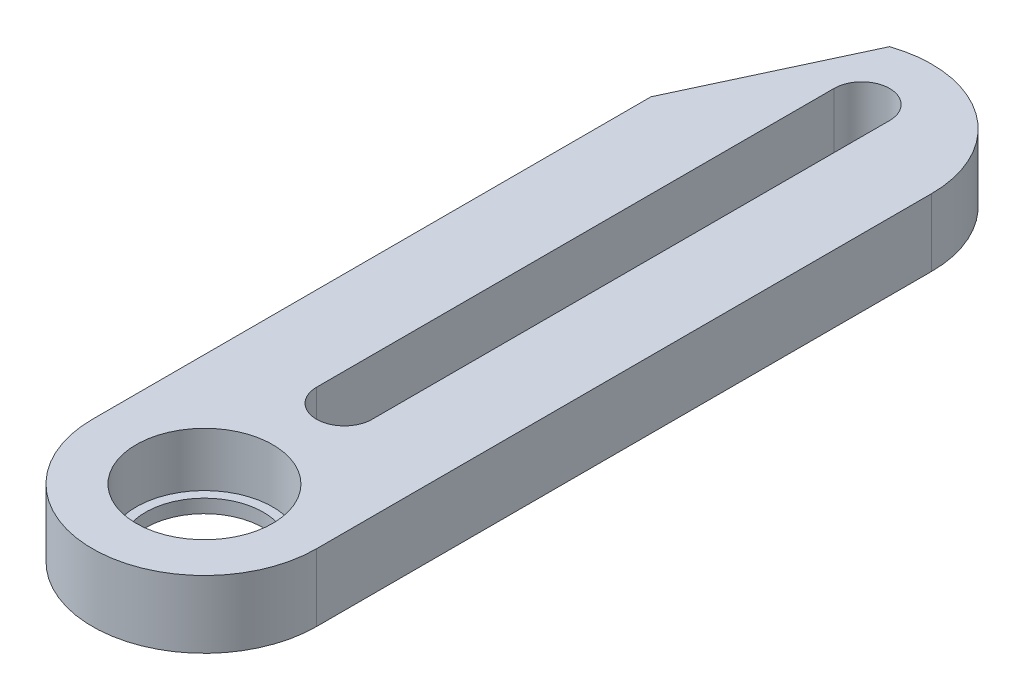
ISO-10303-21;
HEADER;
FILE_DESCRIPTION(('STEP AP214'),'2;1');
FILE_NAME('part.step','',(''),(''),'','','');
FILE_SCHEMA(('AUTOMOTIVE_DESIGN { 1 0 10303 214 1 1 1 1 }'));
ENDSEC;
DATA;
#1=APPLICATION_CONTEXT('core data for automotive mechanical design processes');
#2=APPLICATION_PROTOCOL_DEFINITION('international standard','automotive_design',2000,#1);
#3=PRODUCT_CONTEXT('',#1,'mechanical');
#4=PRODUCT('Part','Part','',(#3));
#5=PRODUCT_RELATED_PRODUCT_CATEGORY('part','',(#4));
#6=PRODUCT_DEFINITION_FORMATION('','',#4);
#7=PRODUCT_DEFINITION_CONTEXT('part definition',#1,'design');
#8=PRODUCT_DEFINITION('design','',#6,#7);
#9=PRODUCT_DEFINITION_SHAPE('','',#8);
#10=(LENGTH_UNIT() NAMED_UNIT(*) SI_UNIT(.MILLI.,.METRE.));
#11=(NAMED_UNIT(*) PLANE_ANGLE_UNIT() SI_UNIT($,.RADIAN.));
#12=(NAMED_UNIT(*) SI_UNIT($,.STERADIAN.) SOLID_ANGLE_UNIT());
#13=UNCERTAINTY_MEASURE_WITH_UNIT(LENGTH_MEASURE(1.E-05),#10,'distance_accuracy_value','');
#14=(GEOMETRIC_REPRESENTATION_CONTEXT(3) GLOBAL_UNCERTAINTY_ASSIGNED_CONTEXT((#13)) GLOBAL_UNIT_ASSIGNED_CONTEXT((#10,
#11,#12)) REPRESENTATION_CONTEXT('',''));
#15=CARTESIAN_POINT('',(0.,0.,0.));
#16=DIRECTION('',(0.,0.,1.));
#17=DIRECTION('',(1.,0.,0.));
#18=AXIS2_PLACEMENT_3D('',#15,#16,#17);
#19=CARTESIAN_POINT('',(0.,4.,0.));
#20=DIRECTION('',(0.,-1.,0.));
#21=DIRECTION('',(0.,0.,-1.));
#22=AXIS2_PLACEMENT_3D('',#19,#20,#21);
#23=CYLINDRICAL_SURFACE('',#22,6.65);
#24=CARTESIAN_POINT('',(0.,0.,0.));
#25=DIRECTION('',(0.,1.,0.));
#26=DIRECTION('',(0.,0.,1.));
#27=AXIS2_PLACEMENT_3D('',#24,#25,#26);
#28=CIRCLE('',#27,6.65);
#29=CARTESIAN_POINT('',(-6.65,0.,0.));
#30=VERTEX_POINT('',#29);
#31=CARTESIAN_POINT('',(6.65,0.,0.));
#32=VERTEX_POINT('',#31);
#33=EDGE_CURVE('E126',#30,#32,#28,.T.);
#34=ORIENTED_EDGE('',*,*,#33,.T.);
#35=DIRECTION('',(0.,-1.,0.));
#36=VECTOR('',#35,1.);
#37=CARTESIAN_POINT('',(6.65,4.,0.));
#38=LINE('',#37,#36);
#39=CARTESIAN_POINT('',(6.65,4.,0.));
#40=VERTEX_POINT('',#39);
#41=EDGE_CURVE('E46',#40,#32,#38,.T.);
#42=ORIENTED_EDGE('',*,*,#41,.F.);
#43=CARTESIAN_POINT('',(0.,4.,0.));
#44=DIRECTION('',(0.,1.,0.));
#45=DIRECTION('',(0.,0.,1.));
#46=AXIS2_PLACEMENT_3D('',#43,#44,#45);
#47=CIRCLE('',#46,6.65);
#48=CARTESIAN_POINT('',(-6.65,4.,0.));
#49=VERTEX_POINT('',#48);
#50=EDGE_CURVE('E115',#49,#40,#47,.T.);
#51=ORIENTED_EDGE('',*,*,#50,.F.);
#52=DIRECTION('',(0.,-1.,0.));
#53=VECTOR('',#52,1.);
#54=CARTESIAN_POINT('',(-6.65,4.,0.));
#55=LINE('',#54,#53);
#56=EDGE_CURVE('E62',#49,#30,#55,.T.);
#57=ORIENTED_EDGE('',*,*,#56,.T.);
#58=EDGE_LOOP('',(#34,#42,#51,#57));
#59=FACE_BOUND('',#58,.T.);
#60=ADVANCED_FACE('F38',(#59),#23,.T.);
#61=CARTESIAN_POINT('',(6.65,4.,0.));
#62=DIRECTION('',(1.,0.,0.));
#63=DIRECTION('',(0.,0.,-1.));
#64=AXIS2_PLACEMENT_3D('',#61,#62,#63);
#65=PLANE('',#64);
#66=DIRECTION('',(0.,0.,1.));
#67=VECTOR('',#66,1.);
#68=CARTESIAN_POINT('',(6.65,0.,0.));
#69=LINE('',#68,#67);
#70=CARTESIAN_POINT('',(6.65,0.,-36.5));
#71=VERTEX_POINT('',#70);
#72=EDGE_CURVE('E159',#71,#32,#69,.T.);
#73=ORIENTED_EDGE('',*,*,#72,.F.);
#74=DIRECTION('',(0.,-1.,0.));
#75=VECTOR('',#74,1.);
#76=CARTESIAN_POINT('',(6.65,4.,-36.5));
#77=LINE('',#76,#75);
#78=CARTESIAN_POINT('',(6.65,4.,-36.5));
#79=VERTEX_POINT('',#78);
#80=EDGE_CURVE('E130',#79,#71,#77,.T.);
#81=ORIENTED_EDGE('',*,*,#80,.F.);
#82=DIRECTION('',(0.,0.,1.));
#83=VECTOR('',#82,1.);
#84=CARTESIAN_POINT('',(6.65,4.,0.));
#85=LINE('',#84,#83);
#86=EDGE_CURVE('E122',#79,#40,#85,.T.);
#87=ORIENTED_EDGE('',*,*,#86,.T.);
#88=ORIENTED_EDGE('',*,*,#41,.T.);
#89=EDGE_LOOP('',(#73,#81,#87,#88));
#90=FACE_BOUND('',#89,.T.);
#91=ADVANCED_FACE('F133',(#90),#65,.T.);
#92=CARTESIAN_POINT('',(0.,4.,-36.5));
#93=DIRECTION('',(0.,-1.,0.));
#94=DIRECTION('',(0.,0.,-1.));
#95=AXIS2_PLACEMENT_3D('',#92,#93,#94);
#96=CYLINDRICAL_SURFACE('',#95,6.65);
#97=DIRECTION('',(0.,-1.,0.));
#98=VECTOR('',#97,1.);
#99=CARTESIAN_POINT('',(-2.15,4.,-42.7928530890209));
#100=LINE('',#99,#98);
#101=CARTESIAN_POINT('',(-2.15,4.,-42.7928530890209));
#102=VERTEX_POINT('',#101);
#103=CARTESIAN_POINT('',(-2.15,0.,-42.7928530890209));
#104=VERTEX_POINT('',#103);
#105=EDGE_CURVE('E53',#102,#104,#100,.T.);
#106=ORIENTED_EDGE('',*,*,#105,.F.);
#107=CARTESIAN_POINT('',(0.,4.,-36.5));
#108=DIRECTION('',(0.,1.,0.));
#109=DIRECTION('',(0.,0.,1.));
#110=AXIS2_PLACEMENT_3D('',#107,#108,#109);
#111=CIRCLE('',#110,6.65);
#112=EDGE_CURVE('E135',#102,#79,#111,.F.);
#113=ORIENTED_EDGE('',*,*,#112,.T.);
#114=ORIENTED_EDGE('',*,*,#80,.T.);
#115=CARTESIAN_POINT('',(0.,0.,-36.5));
#116=DIRECTION('',(0.,1.,0.));
#117=DIRECTION('',(0.,0.,1.));
#118=AXIS2_PLACEMENT_3D('',#115,#116,#117);
#119=CIRCLE('',#118,6.65);
#120=EDGE_CURVE('E161',#104,#71,#119,.F.);
#121=ORIENTED_EDGE('',*,*,#120,.F.);
#122=EDGE_LOOP('',(#106,#113,#114,#121));
#123=FACE_BOUND('',#122,.T.);
#124=ADVANCED_FACE('F215',(#123),#96,.T.);
#125=CARTESIAN_POINT('',(0.,4.,-8.3));
#126=DIRECTION('',(0.,-1.,0.));
#127=DIRECTION('',(0.,0.,-1.));
#128=AXIS2_PLACEMENT_3D('',#125,#126,#127);
#129=CYLINDRICAL_SURFACE('',#128,1.65);
#130=CARTESIAN_POINT('',(0.,0.,-8.3));
#131=DIRECTION('',(0.,1.,0.));
#132=DIRECTION('',(0.,0.,1.));
#133=AXIS2_PLACEMENT_3D('',#130,#131,#132);
#134=CIRCLE('',#133,1.65);
#135=CARTESIAN_POINT('',(-1.65,0.,-8.3));
#136=VERTEX_POINT('',#135);
#137=CARTESIAN_POINT('',(1.65,0.,-8.3));
#138=VERTEX_POINT('',#137);
#139=EDGE_CURVE('E145',#136,#138,#134,.T.);
#140=ORIENTED_EDGE('',*,*,#139,.F.);
#141=DIRECTION('',(0.,-1.,0.));
#142=VECTOR('',#141,1.);
#143=CARTESIAN_POINT('',(-1.65,4.,-8.3));
#144=LINE('',#143,#142);
#145=CARTESIAN_POINT('',(-1.65,4.,-8.3));
#146=VERTEX_POINT('',#145);
#147=EDGE_CURVE('E98',#146,#136,#144,.T.);
#148=ORIENTED_EDGE('',*,*,#147,.F.);
#149=CARTESIAN_POINT('',(0.,4.,-8.3));
#150=DIRECTION('',(0.,1.,0.));
#151=DIRECTION('',(0.,0.,1.));
#152=AXIS2_PLACEMENT_3D('',#149,#150,#151);
#153=CIRCLE('',#152,1.65);
#154=CARTESIAN_POINT('',(1.65,4.,-8.3));
#155=VERTEX_POINT('',#154);
#156=EDGE_CURVE('E166',#146,#155,#153,.T.);
#157=ORIENTED_EDGE('',*,*,#156,.T.);
#158=DIRECTION('',(0.,-1.,0.));
#159=VECTOR('',#158,1.);
#160=CARTESIAN_POINT('',(1.65,4.,-8.3));
#161=LINE('',#160,#159);
#162=EDGE_CURVE('E144',#155,#138,#161,.T.);
#163=ORIENTED_EDGE('',*,*,#162,.T.);
#164=EDGE_LOOP('',(#140,#148,#157,#163));
#165=FACE_BOUND('',#164,.T.);
#166=ADVANCED_FACE('F40',(#165),#129,.F.);
#167=CARTESIAN_POINT('',(-1.65,4.,0.));
#168=DIRECTION('',(1.,0.,0.));
#169=DIRECTION('',(0.,0.,-1.));
#170=AXIS2_PLACEMENT_3D('',#167,#168,#169);
#171=PLANE('',#170);
#172=DIRECTION('',(0.,0.,1.));
#173=VECTOR('',#172,1.);
#174=CARTESIAN_POINT('',(-1.65,0.,0.));
#175=LINE('',#174,#173);
#176=CARTESIAN_POINT('',(-1.65,0.,-39.));
#177=VERTEX_POINT('',#176);
#178=EDGE_CURVE('E148',#177,#136,#175,.T.);
#179=ORIENTED_EDGE('',*,*,#178,.F.);
#180=DIRECTION('',(0.,-1.,0.));
#181=VECTOR('',#180,1.);
#182=CARTESIAN_POINT('',(-1.65,4.,-39.));
#183=LINE('',#182,#181);
#184=CARTESIAN_POINT('',(-1.65,4.,-39.));
#185=VERTEX_POINT('',#184);
#186=EDGE_CURVE('E172',#185,#177,#183,.T.);
#187=ORIENTED_EDGE('',*,*,#186,.F.);
#188=DIRECTION('',(0.,0.,1.));
#189=VECTOR('',#188,1.);
#190=CARTESIAN_POINT('',(-1.65,4.,0.));
#191=LINE('',#190,#189);
#192=EDGE_CURVE('E178',#185,#146,#191,.T.);
#193=ORIENTED_EDGE('',*,*,#192,.T.);
#194=ORIENTED_EDGE('',*,*,#147,.T.);
#195=EDGE_LOOP('',(#179,#187,#193,#194));
#196=FACE_BOUND('',#195,.T.);
#197=ADVANCED_FACE('F176',(#196),#171,.T.);
#198=CARTESIAN_POINT('',(0.,4.,-39.));
#199=DIRECTION('',(0.,-1.,0.));
#200=DIRECTION('',(0.,0.,-1.));
#201=AXIS2_PLACEMENT_3D('',#198,#199,#200);
#202=CYLINDRICAL_SURFACE('',#201,1.65);
#203=CARTESIAN_POINT('',(0.,0.,-39.));
#204=DIRECTION('',(0.,1.,0.));
#205=DIRECTION('',(0.,0.,1.));
#206=AXIS2_PLACEMENT_3D('',#203,#204,#205);
#207=CIRCLE('',#206,1.65);
#208=CARTESIAN_POINT('',(1.65,0.,-39.));
#209=VERTEX_POINT('',#208);
#210=EDGE_CURVE('E152',#209,#177,#207,.T.);
#211=ORIENTED_EDGE('',*,*,#210,.F.);
#212=DIRECTION('',(0.,-1.,0.));
#213=VECTOR('',#212,1.);
#214=CARTESIAN_POINT('',(1.65,4.,-39.));
#215=LINE('',#214,#213);
#216=CARTESIAN_POINT('',(1.65,4.,-39.));
#217=VERTEX_POINT('',#216);
#218=EDGE_CURVE('E170',#217,#209,#215,.T.);
#219=ORIENTED_EDGE('',*,*,#218,.F.);
#220=CARTESIAN_POINT('',(0.,4.,-39.));
#221=DIRECTION('',(0.,1.,0.));
#222=DIRECTION('',(0.,0.,1.));
#223=AXIS2_PLACEMENT_3D('',#220,#221,#222);
#224=CIRCLE('',#223,1.65);
#225=EDGE_CURVE('E190',#217,#185,#224,.T.);
#226=ORIENTED_EDGE('',*,*,#225,.T.);
#227=ORIENTED_EDGE('',*,*,#186,.T.);
#228=EDGE_LOOP('',(#211,#219,#226,#227));
#229=FACE_BOUND('',#228,.T.);
#230=ADVANCED_FACE('F186',(#229),#202,.F.);
#231=CARTESIAN_POINT('',(-6.65,4.,0.));
#232=DIRECTION('',(-1.,0.,0.));
#233=DIRECTION('',(0.,0.,1.));
#234=AXIS2_PLACEMENT_3D('',#231,#232,#233);
#235=PLANE('',#234);
#236=DIRECTION('',(0.,-1.,0.));
#237=VECTOR('',#236,1.);
#238=CARTESIAN_POINT('',(-6.65,4.,-33.1425719467278));
#239=LINE('',#238,#237);
#240=CARTESIAN_POINT('',(-6.65,4.,-33.1425719467278));
#241=VERTEX_POINT('',#240);
#242=CARTESIAN_POINT('',(-6.65,0.,-33.1425719467278));
#243=VERTEX_POINT('',#242);
#244=EDGE_CURVE('E241',#241,#243,#239,.T.);
#245=ORIENTED_EDGE('',*,*,#244,.T.);
#246=DIRECTION('',(0.,0.,-1.));
#247=VECTOR('',#246,1.);
#248=CARTESIAN_POINT('',(-6.65,0.,0.));
#249=LINE('',#248,#247);
#250=EDGE_CURVE('E163',#30,#243,#249,.T.);
#251=ORIENTED_EDGE('',*,*,#250,.F.);
#252=ORIENTED_EDGE('',*,*,#56,.F.);
#253=DIRECTION('',(0.,0.,-1.));
#254=VECTOR('',#253,1.);
#255=CARTESIAN_POINT('',(-6.65,4.,0.));
#256=LINE('',#255,#254);
#257=EDGE_CURVE('E123',#49,#241,#256,.T.);
#258=ORIENTED_EDGE('',*,*,#257,.T.);
#259=EDGE_LOOP('',(#245,#251,#252,#258));
#260=FACE_BOUND('',#259,.T.);
#261=ADVANCED_FACE('F200',(#260),#235,.T.);
#262=CARTESIAN_POINT('',(1.65,4.,0.));
#263=DIRECTION('',(1.,0.,0.));
#264=DIRECTION('',(0.,0.,-1.));
#265=AXIS2_PLACEMENT_3D('',#262,#263,#264);
#266=PLANE('',#265);
#267=DIRECTION('',(0.,0.,1.));
#268=VECTOR('',#267,1.);
#269=CARTESIAN_POINT('',(1.65,0.,0.));
#270=LINE('',#269,#268);
#271=EDGE_CURVE('E155',#209,#138,#270,.T.);
#272=ORIENTED_EDGE('',*,*,#271,.T.);
#273=ORIENTED_EDGE('',*,*,#162,.F.);
#274=DIRECTION('',(0.,0.,1.));
#275=VECTOR('',#274,1.);
#276=CARTESIAN_POINT('',(1.65,4.,0.));
#277=LINE('',#276,#275);
#278=EDGE_CURVE('E124',#217,#155,#277,.T.);
#279=ORIENTED_EDGE('',*,*,#278,.F.);
#280=ORIENTED_EDGE('',*,*,#218,.T.);
#281=EDGE_LOOP('',(#272,#273,#279,#280));
#282=FACE_BOUND('',#281,.T.);
#283=ADVANCED_FACE('F197',(#282),#266,.F.);
#284=CARTESIAN_POINT('',(0.,4.,0.));
#285=DIRECTION('',(0.,-1.,0.));
#286=DIRECTION('',(0.,0.,-1.));
#287=AXIS2_PLACEMENT_3D('',#284,#285,#286);
#288=CYLINDRICAL_SURFACE('',#287,4.05);
#289=CARTESIAN_POINT('',(0.,0.8,0.));
#290=DIRECTION('',(0.,1.,0.));
#291=DIRECTION('',(0.,0.,1.));
#292=AXIS2_PLACEMENT_3D('',#289,#290,#291);
#293=CIRCLE('',#292,4.05);
#294=CARTESIAN_POINT('',(0.,0.8,4.05));
#295=VERTEX_POINT('',#294);
#296=EDGE_CURVE('E11',#295,#295,#293,.T.);
#297=ORIENTED_EDGE('',*,*,#296,.F.);
#298=EDGE_LOOP('',(#297));
#299=FACE_BOUND('',#298,.T.);
#300=CARTESIAN_POINT('',(0.,4.,0.));
#301=DIRECTION('',(0.,1.,0.));
#302=DIRECTION('',(0.,0.,1.));
#303=AXIS2_PLACEMENT_3D('',#300,#301,#302);
#304=CIRCLE('',#303,4.05);
#305=CARTESIAN_POINT('',(0.,4.,4.05));
#306=VERTEX_POINT('',#305);
#307=EDGE_CURVE('E141',#306,#306,#304,.T.);
#308=ORIENTED_EDGE('',*,*,#307,.T.);
#309=EDGE_LOOP('',(#308));
#310=FACE_BOUND('',#309,.T.);
#311=ADVANCED_FACE('F199',(#299,#310),#288,.F.);
#312=CARTESIAN_POINT('',(0.,4.,0.));
#313=DIRECTION('',(0.,1.,0.));
#314=DIRECTION('',(0.,0.,1.));
#315=AXIS2_PLACEMENT_3D('',#312,#313,#314);
#316=PLANE('',#315);
#317=DIRECTION('',(-0.422618261740694,0.,0.906307787036652));
#318=VECTOR('',#317,1.);
#319=CARTESIAN_POINT('',(-6.65,4.,-33.1425719467278));
#320=LINE('',#319,#318);
#321=EDGE_CURVE('E244',#102,#241,#320,.T.);
#322=ORIENTED_EDGE('',*,*,#321,.T.);
#323=ORIENTED_EDGE('',*,*,#257,.F.);
#324=ORIENTED_EDGE('',*,*,#50,.T.);
#325=ORIENTED_EDGE('',*,*,#86,.F.);
#326=ORIENTED_EDGE('',*,*,#112,.F.);
#327=EDGE_LOOP('',(#322,#323,#324,#325,#326));
#328=FACE_BOUND('',#327,.T.);
#329=ORIENTED_EDGE('',*,*,#156,.F.);
#330=ORIENTED_EDGE('',*,*,#192,.F.);
#331=ORIENTED_EDGE('',*,*,#225,.F.);
#332=ORIENTED_EDGE('',*,*,#278,.T.);
#333=EDGE_LOOP('',(#329,#330,#331,#332));
#334=FACE_BOUND('',#333,.T.);
#335=ORIENTED_EDGE('',*,*,#307,.F.);
#336=EDGE_LOOP('',(#335));
#337=FACE_BOUND('',#336,.T.);
#338=ADVANCED_FACE('F118',(#328,#334,#337),#316,.T.);
#339=CARTESIAN_POINT('',(0.,0.,0.));
#340=DIRECTION('',(0.,1.,0.));
#341=DIRECTION('',(0.,0.,1.));
#342=AXIS2_PLACEMENT_3D('',#339,#340,#341);
#343=PLANE('',#342);
#344=CARTESIAN_POINT('',(0.,0.,0.));
#345=DIRECTION('',(0.,1.,0.));
#346=DIRECTION('',(0.,0.,1.));
#347=AXIS2_PLACEMENT_3D('',#344,#345,#346);
#348=CIRCLE('',#347,3.5);
#349=CARTESIAN_POINT('',(0.,0.,3.5));
#350=VERTEX_POINT('',#349);
#351=EDGE_CURVE('E149',#350,#350,#348,.T.);
#352=ORIENTED_EDGE('',*,*,#351,.T.);
#353=EDGE_LOOP('',(#352));
#354=FACE_BOUND('',#353,.T.);
#355=ORIENTED_EDGE('',*,*,#139,.T.);
#356=ORIENTED_EDGE('',*,*,#271,.F.);
#357=ORIENTED_EDGE('',*,*,#210,.T.);
#358=ORIENTED_EDGE('',*,*,#178,.T.);
#359=EDGE_LOOP('',(#355,#356,#357,#358));
#360=FACE_BOUND('',#359,.T.);
#361=ORIENTED_EDGE('',*,*,#250,.T.);
#362=DIRECTION('',(-0.422618261740694,0.,0.906307787036652));
#363=VECTOR('',#362,1.);
#364=CARTESIAN_POINT('',(-6.65,0.,-33.1425719467278));
#365=LINE('',#364,#363);
#366=EDGE_CURVE('E239',#104,#243,#365,.T.);
#367=ORIENTED_EDGE('',*,*,#366,.F.);
#368=ORIENTED_EDGE('',*,*,#120,.T.);
#369=ORIENTED_EDGE('',*,*,#72,.T.);
#370=ORIENTED_EDGE('',*,*,#33,.F.);
#371=EDGE_LOOP('',(#361,#367,#368,#369,#370));
#372=FACE_BOUND('',#371,.T.);
#373=ADVANCED_FACE('F182',(#354,#360,#372),#343,.F.);
#374=CARTESIAN_POINT('',(0.,0.8,0.));
#375=DIRECTION('',(0.,1.,0.));
#376=DIRECTION('',(0.,0.,1.));
#377=AXIS2_PLACEMENT_3D('',#374,#375,#376);
#378=PLANE('',#377);
#379=CARTESIAN_POINT('',(0.,0.8,0.));
#380=DIRECTION('',(0.,1.,0.));
#381=DIRECTION('',(0.,0.,1.));
#382=AXIS2_PLACEMENT_3D('',#379,#380,#381);
#383=CIRCLE('',#382,3.5);
#384=CARTESIAN_POINT('',(0.,0.8,3.5));
#385=VERTEX_POINT('',#384);
#386=EDGE_CURVE('E246',#385,#385,#383,.T.);
#387=ORIENTED_EDGE('',*,*,#386,.F.);
#388=EDGE_LOOP('',(#387));
#389=FACE_BOUND('',#388,.T.);
#390=ORIENTED_EDGE('',*,*,#296,.T.);
#391=EDGE_LOOP('',(#390));
#392=FACE_BOUND('',#391,.T.);
#393=ADVANCED_FACE('F223',(#389,#392),#378,.T.);
#394=CARTESIAN_POINT('',(0.,0.,0.));
#395=DIRECTION('',(0.,1.,0.));
#396=DIRECTION('',(0.,0.,1.));
#397=AXIS2_PLACEMENT_3D('',#394,#395,#396);
#398=CYLINDRICAL_SURFACE('',#397,3.5);
#399=ORIENTED_EDGE('',*,*,#351,.F.);
#400=EDGE_LOOP('',(#399));
#401=FACE_BOUND('',#400,.T.);
#402=ORIENTED_EDGE('',*,*,#386,.T.);
#403=EDGE_LOOP('',(#402));
#404=FACE_BOUND('',#403,.T.);
#405=ADVANCED_FACE('F229',(#401,#404),#398,.F.);
#406=CARTESIAN_POINT('',(-6.65,4.,-33.1425719467278));
#407=DIRECTION('',(0.906307787036652,0.,0.422618261740694));
#408=DIRECTION('',(0.422618261740694,0.,-0.906307787036652));
#409=AXIS2_PLACEMENT_3D('',#406,#407,#408);
#410=PLANE('',#409);
#411=ORIENTED_EDGE('',*,*,#366,.T.);
#412=ORIENTED_EDGE('',*,*,#244,.F.);
#413=ORIENTED_EDGE('',*,*,#321,.F.);
#414=ORIENTED_EDGE('',*,*,#105,.T.);
#415=EDGE_LOOP('',(#411,#412,#413,#414));
#416=FACE_BOUND('',#415,.T.);
#417=ADVANCED_FACE('F233',(#416),#410,.F.);
#418=CLOSED_SHELL('',(#60,#91,#124,#166,#197,#230,#261,#283,#311,#338,#373,#393,#405,#417));
#419=MANIFOLD_SOLID_BREP('B2',#418);
#420=ADVANCED_BREP_SHAPE_REPRESENTATION('',(#18,#419),#14);
#421=SHAPE_DEFINITION_REPRESENTATION(#9,#420);
ENDSEC;
END-ISO-10303-21;
